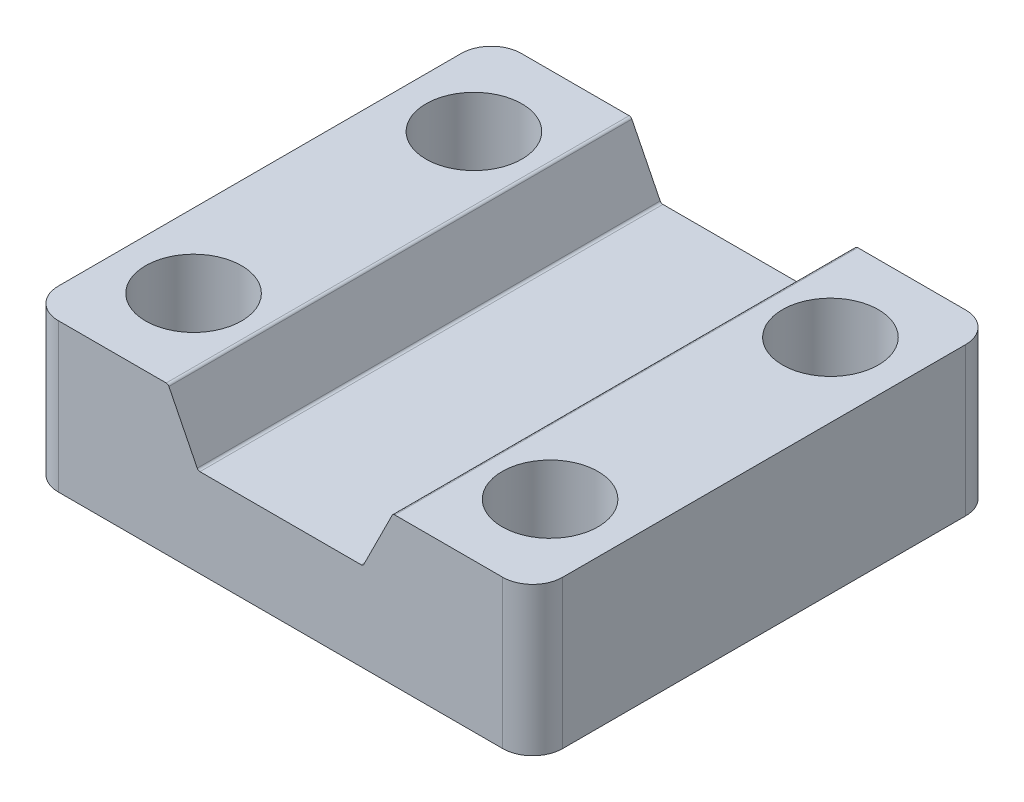
ISO-10303-21;
HEADER;
FILE_DESCRIPTION(('STEP AP214'),'2;1');
FILE_NAME('part.step','',(''),(''),'','','');
FILE_SCHEMA(('AUTOMOTIVE_DESIGN { 1 0 10303 214 1 1 1 1 }'));
ENDSEC;
DATA;
#1=APPLICATION_CONTEXT('core data for automotive mechanical design processes');
#2=APPLICATION_PROTOCOL_DEFINITION('international standard','automotive_design',2000,#1);
#3=PRODUCT_CONTEXT('',#1,'mechanical');
#4=PRODUCT('Part','Part','',(#3));
#5=PRODUCT_RELATED_PRODUCT_CATEGORY('part','',(#4));
#6=PRODUCT_DEFINITION_FORMATION('','',#4);
#7=PRODUCT_DEFINITION_CONTEXT('part definition',#1,'design');
#8=PRODUCT_DEFINITION('design','',#6,#7);
#9=PRODUCT_DEFINITION_SHAPE('','',#8);
#10=(LENGTH_UNIT() NAMED_UNIT(*) SI_UNIT(.MILLI.,.METRE.));
#11=(NAMED_UNIT(*) PLANE_ANGLE_UNIT() SI_UNIT($,.RADIAN.));
#12=(NAMED_UNIT(*) SI_UNIT($,.STERADIAN.) SOLID_ANGLE_UNIT());
#13=UNCERTAINTY_MEASURE_WITH_UNIT(LENGTH_MEASURE(1.E-05),#10,'distance_accuracy_value','');
#14=(GEOMETRIC_REPRESENTATION_CONTEXT(3) GLOBAL_UNCERTAINTY_ASSIGNED_CONTEXT((#13)) GLOBAL_UNIT_ASSIGNED_CONTEXT((#10,
#11,#12)) REPRESENTATION_CONTEXT('',''));
#15=CARTESIAN_POINT('',(0.,0.,0.));
#16=DIRECTION('',(0.,0.,1.));
#17=DIRECTION('',(1.,0.,0.));
#18=AXIS2_PLACEMENT_3D('',#15,#16,#17);
#19=CARTESIAN_POINT('',(0.,12.573,0.));
#20=DIRECTION('',(0.,1.,0.));
#21=DIRECTION('',(0.,0.,1.));
#22=AXIS2_PLACEMENT_3D('',#19,#20,#21);
#23=PLANE('',#22);
#24=CARTESIAN_POINT('',(-15.1003,12.573,-11.8745));
#25=DIRECTION('',(0.,1.,0.));
#26=DIRECTION('',(0.,0.,1.));
#27=AXIS2_PLACEMENT_3D('',#24,#25,#26);
#28=CIRCLE('',#27,4.06400000000003);
#29=CARTESIAN_POINT('',(-15.1003,12.573,-7.81049999999997));
#30=VERTEX_POINT('',#29);
#31=EDGE_CURVE('E298',#30,#30,#28,.T.);
#32=ORIENTED_EDGE('',*,*,#31,.F.);
#33=EDGE_LOOP('',(#32));
#34=FACE_BOUND('',#33,.T.);
#35=CARTESIAN_POINT('',(-15.1003,12.573,11.8745));
#36=DIRECTION('',(0.,1.,0.));
#37=DIRECTION('',(0.,0.,1.));
#38=AXIS2_PLACEMENT_3D('',#35,#36,#37);
#39=CIRCLE('',#38,4.06400000000003);
#40=CARTESIAN_POINT('',(-15.1003,12.573,15.9385));
#41=VERTEX_POINT('',#40);
#42=EDGE_CURVE('E286',#41,#41,#39,.T.);
#43=ORIENTED_EDGE('',*,*,#42,.F.);
#44=EDGE_LOOP('',(#43));
#45=FACE_BOUND('',#44,.T.);
#46=DIRECTION('',(-1.,0.,0.));
#47=VECTOR('',#46,1.);
#48=CARTESIAN_POINT('',(21.3614,12.573,-19.6088));
#49=LINE('',#48,#47);
#50=CARTESIAN_POINT('',(-9.6819806331425,12.573,-19.6088));
#51=VERTEX_POINT('',#50);
#52=CARTESIAN_POINT('',(-18.8214,12.573,-19.6088));
#53=VERTEX_POINT('',#52);
#54=EDGE_CURVE('E192',#51,#53,#49,.T.);
#55=ORIENTED_EDGE('',*,*,#54,.T.);
#56=CARTESIAN_POINT('',(-18.8214,12.573,-17.0688));
#57=DIRECTION('',(0.,1.,0.));
#58=DIRECTION('',(0.,0.,1.));
#59=AXIS2_PLACEMENT_3D('',#56,#57,#58);
#60=CIRCLE('',#59,2.54);
#61=CARTESIAN_POINT('',(-21.3614,12.573,-17.0688));
#62=VERTEX_POINT('',#61);
#63=EDGE_CURVE('E231',#53,#62,#60,.T.);
#64=ORIENTED_EDGE('',*,*,#63,.T.);
#65=DIRECTION('',(0.,0.,1.));
#66=VECTOR('',#65,1.);
#67=CARTESIAN_POINT('',(-21.3614,12.573,-19.6088));
#68=LINE('',#67,#66);
#69=CARTESIAN_POINT('',(-21.3614,12.573,17.0688));
#70=VERTEX_POINT('',#69);
#71=EDGE_CURVE('E268',#62,#70,#68,.T.);
#72=ORIENTED_EDGE('',*,*,#71,.T.);
#73=CARTESIAN_POINT('',(-18.8214,12.573,17.0688));
#74=DIRECTION('',(0.,1.,0.));
#75=DIRECTION('',(0.,0.,1.));
#76=AXIS2_PLACEMENT_3D('',#73,#74,#75);
#77=CIRCLE('',#76,2.54);
#78=CARTESIAN_POINT('',(-18.8214,12.573,19.6088));
#79=VERTEX_POINT('',#78);
#80=EDGE_CURVE('E229',#70,#79,#77,.T.);
#81=ORIENTED_EDGE('',*,*,#80,.T.);
#82=DIRECTION('',(1.,0.,0.));
#83=VECTOR('',#82,1.);
#84=CARTESIAN_POINT('',(-21.3614,12.573,19.6088));
#85=LINE('',#84,#83);
#86=CARTESIAN_POINT('',(-9.6819806331425,12.573,19.6088));
#87=VERTEX_POINT('',#86);
#88=EDGE_CURVE('E267',#79,#87,#85,.T.);
#89=ORIENTED_EDGE('',*,*,#88,.T.);
#90=DIRECTION('',(0.,0.,1.));
#91=VECTOR('',#90,1.);
#92=CARTESIAN_POINT('',(-9.6819806331425,12.573,-19.6088));
#93=LINE('',#92,#91);
#94=EDGE_CURVE('E162',#87,#51,#93,.F.);
#95=ORIENTED_EDGE('',*,*,#94,.T.);
#96=EDGE_LOOP('',(#55,#64,#72,#81,#89,#95));
#97=FACE_BOUND('',#96,.T.);
#98=ADVANCED_FACE('F37',(#34,#45,#97),#23,.T.);
#99=CARTESIAN_POINT('',(21.3614,0.,-19.6088));
#100=DIRECTION('',(0.,0.,-1.));
#101=DIRECTION('',(-1.,0.,0.));
#102=AXIS2_PLACEMENT_3D('',#99,#100,#101);
#103=PLANE('',#102);
#104=DIRECTION('',(-1.,0.,0.));
#105=VECTOR('',#104,1.);
#106=CARTESIAN_POINT('',(21.3614,0.,-19.6088));
#107=LINE('',#106,#105);
#108=CARTESIAN_POINT('',(18.8214,0.,-19.6088));
#109=VERTEX_POINT('',#108);
#110=CARTESIAN_POINT('',(-18.8214,0.,-19.6088));
#111=VERTEX_POINT('',#110);
#112=EDGE_CURVE('E280',#109,#111,#107,.T.);
#113=ORIENTED_EDGE('',*,*,#112,.T.);
#114=DIRECTION('',(0.,1.,0.));
#115=VECTOR('',#114,1.);
#116=CARTESIAN_POINT('',(-18.8214,0.,-19.6088));
#117=LINE('',#116,#115);
#118=EDGE_CURVE('E226',#111,#53,#117,.T.);
#119=ORIENTED_EDGE('',*,*,#118,.T.);
#120=ORIENTED_EDGE('',*,*,#54,.F.);
#121=CARTESIAN_POINT('',(-9.6819806331425,12.319,-19.6088));
#122=DIRECTION('',(0.,0.,-1.));
#123=DIRECTION('',(-1.,0.,0.));
#124=AXIS2_PLACEMENT_3D('',#121,#122,#123);
#125=CIRCLE('',#124,0.254000000000001);
#126=CARTESIAN_POINT('',(-9.45479612662852,12.432592253257,-19.6088));
#127=VERTEX_POINT('',#126);
#128=EDGE_CURVE('E178',#51,#127,#125,.T.);
#129=ORIENTED_EDGE('',*,*,#128,.T.);
#130=DIRECTION('',(0.447213595499961,-0.894427190999914,0.));
#131=VECTOR('',#130,1.);
#132=CARTESIAN_POINT('',(1.6814800000001,-9.83996000000004,-19.6088));
#133=LINE('',#132,#131);
#134=CARTESIAN_POINT('',(-7.05520387337151,7.63340774674301,-19.6088));
#135=VERTEX_POINT('',#134);
#136=EDGE_CURVE('E168',#135,#127,#133,.F.);
#137=ORIENTED_EDGE('',*,*,#136,.F.);
#138=CARTESIAN_POINT('',(-6.82801936685753,7.747,-19.6088));
#139=DIRECTION('',(0.,0.,-1.));
#140=DIRECTION('',(-1.,0.,0.));
#141=AXIS2_PLACEMENT_3D('',#138,#139,#140);
#142=CIRCLE('',#141,0.254000000000001);
#143=CARTESIAN_POINT('',(-6.82801936685753,7.493,-19.6088));
#144=VERTEX_POINT('',#143);
#145=EDGE_CURVE('E151',#135,#144,#142,.F.);
#146=ORIENTED_EDGE('',*,*,#145,.T.);
#147=DIRECTION('',(-1.,0.,0.));
#148=VECTOR('',#147,1.);
#149=CARTESIAN_POINT('',(6.985,7.493,-19.6088));
#150=LINE('',#149,#148);
#151=CARTESIAN_POINT('',(6.82801936685753,7.493,-19.6088));
#152=VERTEX_POINT('',#151);
#153=EDGE_CURVE('E180',#152,#144,#150,.T.);
#154=ORIENTED_EDGE('',*,*,#153,.F.);
#155=CARTESIAN_POINT('',(6.82801936685753,7.747,-19.6088));
#156=DIRECTION('',(0.,0.,-1.));
#157=DIRECTION('',(-1.,0.,0.));
#158=AXIS2_PLACEMENT_3D('',#155,#156,#157);
#159=CIRCLE('',#158,0.254000000000001);
#160=CARTESIAN_POINT('',(7.0552038733715,7.63340774674301,-19.6088));
#161=VERTEX_POINT('',#160);
#162=EDGE_CURVE('E220',#152,#161,#159,.F.);
#163=ORIENTED_EDGE('',*,*,#162,.T.);
#164=DIRECTION('',(0.447213595499961,0.894427190999914,0.));
#165=VECTOR('',#164,1.);
#166=CARTESIAN_POINT('',(6.86308000000002,7.24916000000005,-19.6088));
#167=LINE('',#166,#165);
#168=CARTESIAN_POINT('',(9.45479612662852,12.432592253257,-19.6088));
#169=VERTEX_POINT('',#168);
#170=EDGE_CURVE('E185',#169,#161,#167,.F.);
#171=ORIENTED_EDGE('',*,*,#170,.F.);
#172=CARTESIAN_POINT('',(9.6819806331425,12.319,-19.6088));
#173=DIRECTION('',(0.,0.,-1.));
#174=DIRECTION('',(-1.,0.,0.));
#175=AXIS2_PLACEMENT_3D('',#172,#173,#174);
#176=CIRCLE('',#175,0.254000000000001);
#177=CARTESIAN_POINT('',(9.6819806331425,12.573,-19.6088));
#178=VERTEX_POINT('',#177);
#179=EDGE_CURVE('E207',#169,#178,#176,.T.);
#180=ORIENTED_EDGE('',*,*,#179,.T.);
#181=CARTESIAN_POINT('',(18.8214,12.573,-19.6088));
#182=VERTEX_POINT('',#181);
#183=EDGE_CURVE('E270',#182,#178,#49,.T.);
#184=ORIENTED_EDGE('',*,*,#183,.F.);
#185=DIRECTION('',(0.,1.,0.));
#186=VECTOR('',#185,1.);
#187=CARTESIAN_POINT('',(18.8214,0.,-19.6088));
#188=LINE('',#187,#186);
#189=EDGE_CURVE('E224',#182,#109,#188,.F.);
#190=ORIENTED_EDGE('',*,*,#189,.T.);
#191=EDGE_LOOP('',(#113,#119,#120,#129,#137,#146,#154,#163,#171,#180,#184,#190));
#192=FACE_BOUND('',#191,.T.);
#193=ADVANCED_FACE('F176',(#192),#103,.T.);
#194=CARTESIAN_POINT('',(21.3614,0.,19.6088));
#195=DIRECTION('',(1.,0.,0.));
#196=DIRECTION('',(0.,0.,-1.));
#197=AXIS2_PLACEMENT_3D('',#194,#195,#196);
#198=PLANE('',#197);
#199=DIRECTION('',(0.,0.,-1.));
#200=VECTOR('',#199,1.);
#201=CARTESIAN_POINT('',(21.3614,0.,19.6088));
#202=LINE('',#201,#200);
#203=CARTESIAN_POINT('',(21.3614,0.,17.0688));
#204=VERTEX_POINT('',#203);
#205=CARTESIAN_POINT('',(21.3614,0.,-17.0688));
#206=VERTEX_POINT('',#205);
#207=EDGE_CURVE('E196',#204,#206,#202,.T.);
#208=ORIENTED_EDGE('',*,*,#207,.T.);
#209=DIRECTION('',(0.,1.,0.));
#210=VECTOR('',#209,1.);
#211=CARTESIAN_POINT('',(21.3614,0.,-17.0688));
#212=LINE('',#211,#210);
#213=CARTESIAN_POINT('',(21.3614,12.573,-17.0688));
#214=VERTEX_POINT('',#213);
#215=EDGE_CURVE('E248',#206,#214,#212,.T.);
#216=ORIENTED_EDGE('',*,*,#215,.T.);
#217=DIRECTION('',(0.,0.,-1.));
#218=VECTOR('',#217,1.);
#219=CARTESIAN_POINT('',(21.3614,12.573,19.6088));
#220=LINE('',#219,#218);
#221=CARTESIAN_POINT('',(21.3614,12.573,17.0688));
#222=VERTEX_POINT('',#221);
#223=EDGE_CURVE('E189',#222,#214,#220,.T.);
#224=ORIENTED_EDGE('',*,*,#223,.F.);
#225=DIRECTION('',(0.,1.,0.));
#226=VECTOR('',#225,1.);
#227=CARTESIAN_POINT('',(21.3614,0.,17.0688));
#228=LINE('',#227,#226);
#229=EDGE_CURVE('E246',#222,#204,#228,.F.);
#230=ORIENTED_EDGE('',*,*,#229,.T.);
#231=EDGE_LOOP('',(#208,#216,#224,#230));
#232=FACE_BOUND('',#231,.T.);
#233=ADVANCED_FACE('F337',(#232),#198,.T.);
#234=CARTESIAN_POINT('',(-21.3614,0.,19.6088));
#235=DIRECTION('',(0.,0.,1.));
#236=DIRECTION('',(1.,0.,0.));
#237=AXIS2_PLACEMENT_3D('',#234,#235,#236);
#238=PLANE('',#237);
#239=ORIENTED_EDGE('',*,*,#88,.F.);
#240=DIRECTION('',(0.,1.,0.));
#241=VECTOR('',#240,1.);
#242=CARTESIAN_POINT('',(-18.8214,0.,19.6088));
#243=LINE('',#242,#241);
#244=CARTESIAN_POINT('',(-18.8214,0.,19.6088));
#245=VERTEX_POINT('',#244);
#246=EDGE_CURVE('E11',#79,#245,#243,.F.);
#247=ORIENTED_EDGE('',*,*,#246,.T.);
#248=DIRECTION('',(1.,0.,0.));
#249=VECTOR('',#248,1.);
#250=CARTESIAN_POINT('',(-21.3614,0.,19.6088));
#251=LINE('',#250,#249);
#252=CARTESIAN_POINT('',(18.8214,0.,19.6088));
#253=VERTEX_POINT('',#252);
#254=EDGE_CURVE('E260',#245,#253,#251,.T.);
#255=ORIENTED_EDGE('',*,*,#254,.T.);
#256=DIRECTION('',(0.,1.,0.));
#257=VECTOR('',#256,1.);
#258=CARTESIAN_POINT('',(18.8214,0.,19.6088));
#259=LINE('',#258,#257);
#260=CARTESIAN_POINT('',(18.8214,12.573,19.6088));
#261=VERTEX_POINT('',#260);
#262=EDGE_CURVE('E45',#253,#261,#259,.T.);
#263=ORIENTED_EDGE('',*,*,#262,.T.);
#264=CARTESIAN_POINT('',(9.6819806331425,12.573,19.6088));
#265=VERTEX_POINT('',#264);
#266=EDGE_CURVE('E257',#265,#261,#85,.T.);
#267=ORIENTED_EDGE('',*,*,#266,.F.);
#268=CARTESIAN_POINT('',(9.6819806331425,12.319,19.6088));
#269=DIRECTION('',(0.,0.,1.));
#270=DIRECTION('',(1.,0.,0.));
#271=AXIS2_PLACEMENT_3D('',#268,#269,#270);
#272=CIRCLE('',#271,0.254000000000001);
#273=CARTESIAN_POINT('',(9.45479612662852,12.432592253257,19.6088));
#274=VERTEX_POINT('',#273);
#275=EDGE_CURVE('E215',#265,#274,#272,.T.);
#276=ORIENTED_EDGE('',*,*,#275,.T.);
#277=DIRECTION('',(0.447213595499961,0.894427190999914,0.));
#278=VECTOR('',#277,1.);
#279=CARTESIAN_POINT('',(6.985,7.493,19.6088));
#280=LINE('',#279,#278);
#281=CARTESIAN_POINT('',(7.05520387337151,7.63340774674301,19.6088));
#282=VERTEX_POINT('',#281);
#283=EDGE_CURVE('E179',#274,#282,#280,.F.);
#284=ORIENTED_EDGE('',*,*,#283,.T.);
#285=CARTESIAN_POINT('',(6.82801936685753,7.747,19.6088));
#286=DIRECTION('',(0.,0.,1.));
#287=DIRECTION('',(1.,0.,0.));
#288=AXIS2_PLACEMENT_3D('',#285,#286,#287);
#289=CIRCLE('',#288,0.254000000000001);
#290=CARTESIAN_POINT('',(6.82801936685753,7.493,19.6088));
#291=VERTEX_POINT('',#290);
#292=EDGE_CURVE('E222',#282,#291,#289,.F.);
#293=ORIENTED_EDGE('',*,*,#292,.T.);
#294=DIRECTION('',(-1.,0.,0.));
#295=VECTOR('',#294,1.);
#296=CARTESIAN_POINT('',(6.985,7.493,19.6088));
#297=LINE('',#296,#295);
#298=CARTESIAN_POINT('',(-6.82801936685753,7.493,19.6088));
#299=VERTEX_POINT('',#298);
#300=EDGE_CURVE('E183',#291,#299,#297,.T.);
#301=ORIENTED_EDGE('',*,*,#300,.T.);
#302=CARTESIAN_POINT('',(-6.82801936685753,7.747,19.6088));
#303=DIRECTION('',(0.,0.,1.));
#304=DIRECTION('',(1.,0.,0.));
#305=AXIS2_PLACEMENT_3D('',#302,#303,#304);
#306=CIRCLE('',#305,0.254000000000001);
#307=CARTESIAN_POINT('',(-7.05520387337151,7.63340774674301,19.6088));
#308=VERTEX_POINT('',#307);
#309=EDGE_CURVE('E161',#299,#308,#306,.F.);
#310=ORIENTED_EDGE('',*,*,#309,.T.);
#311=DIRECTION('',(0.447213595499961,-0.894427190999914,0.));
#312=VECTOR('',#311,1.);
#313=CARTESIAN_POINT('',(-6.985,7.493,19.6088));
#314=LINE('',#313,#312);
#315=CARTESIAN_POINT('',(-9.45479612662852,12.432592253257,19.6088));
#316=VERTEX_POINT('',#315);
#317=EDGE_CURVE('E171',#308,#316,#314,.F.);
#318=ORIENTED_EDGE('',*,*,#317,.T.);
#319=CARTESIAN_POINT('',(-9.6819806331425,12.319,19.6088));
#320=DIRECTION('',(0.,0.,1.));
#321=DIRECTION('',(1.,0.,0.));
#322=AXIS2_PLACEMENT_3D('',#319,#320,#321);
#323=CIRCLE('',#322,0.254000000000001);
#324=EDGE_CURVE('E212',#316,#87,#323,.T.);
#325=ORIENTED_EDGE('',*,*,#324,.T.);
#326=EDGE_LOOP('',(#239,#247,#255,#263,#267,#276,#284,#293,#301,#310,#318,#325));
#327=FACE_BOUND('',#326,.T.);
#328=ADVANCED_FACE('F256',(#327),#238,.T.);
#329=CARTESIAN_POINT('',(-21.3614,0.,-19.6088));
#330=DIRECTION('',(-1.,0.,0.));
#331=DIRECTION('',(0.,0.,1.));
#332=AXIS2_PLACEMENT_3D('',#329,#330,#331);
#333=PLANE('',#332);
#334=ORIENTED_EDGE('',*,*,#71,.F.);
#335=DIRECTION('',(0.,1.,0.));
#336=VECTOR('',#335,1.);
#337=CARTESIAN_POINT('',(-21.3614,0.,-17.0688));
#338=LINE('',#337,#336);
#339=CARTESIAN_POINT('',(-21.3614,0.,-17.0688));
#340=VERTEX_POINT('',#339);
#341=EDGE_CURVE('E236',#62,#340,#338,.F.);
#342=ORIENTED_EDGE('',*,*,#341,.T.);
#343=DIRECTION('',(0.,0.,1.));
#344=VECTOR('',#343,1.);
#345=CARTESIAN_POINT('',(-21.3614,0.,-19.6088));
#346=LINE('',#345,#344);
#347=CARTESIAN_POINT('',(-21.3614,0.,17.0688));
#348=VERTEX_POINT('',#347);
#349=EDGE_CURVE('E277',#340,#348,#346,.T.);
#350=ORIENTED_EDGE('',*,*,#349,.T.);
#351=DIRECTION('',(0.,1.,0.));
#352=VECTOR('',#351,1.);
#353=CARTESIAN_POINT('',(-21.3614,0.,17.0688));
#354=LINE('',#353,#352);
#355=EDGE_CURVE('E233',#348,#70,#354,.T.);
#356=ORIENTED_EDGE('',*,*,#355,.T.);
#357=EDGE_LOOP('',(#334,#342,#350,#356));
#358=FACE_BOUND('',#357,.T.);
#359=ADVANCED_FACE('F349',(#358),#333,.T.);
#360=CARTESIAN_POINT('',(0.,0.,0.));
#361=DIRECTION('',(0.,1.,0.));
#362=DIRECTION('',(0.,0.,1.));
#363=AXIS2_PLACEMENT_3D('',#360,#361,#362);
#364=PLANE('',#363);
#365=CARTESIAN_POINT('',(15.1003,0.,11.8745));
#366=DIRECTION('',(0.,1.,0.));
#367=DIRECTION('',(0.,0.,1.));
#368=AXIS2_PLACEMENT_3D('',#365,#366,#367);
#369=CIRCLE('',#368,4.06400000000003);
#370=CARTESIAN_POINT('',(15.1003,0.,15.9385));
#371=VERTEX_POINT('',#370);
#372=EDGE_CURVE('E301',#371,#371,#369,.T.);
#373=ORIENTED_EDGE('',*,*,#372,.T.);
#374=EDGE_LOOP('',(#373));
#375=FACE_BOUND('',#374,.T.);
#376=CARTESIAN_POINT('',(-15.1003,0.,-11.8745));
#377=DIRECTION('',(0.,1.,0.));
#378=DIRECTION('',(0.,0.,1.));
#379=AXIS2_PLACEMENT_3D('',#376,#377,#378);
#380=CIRCLE('',#379,4.06400000000003);
#381=CARTESIAN_POINT('',(-15.1003,0.,-7.81049999999997));
#382=VERTEX_POINT('',#381);
#383=EDGE_CURVE('E295',#382,#382,#380,.T.);
#384=ORIENTED_EDGE('',*,*,#383,.T.);
#385=EDGE_LOOP('',(#384));
#386=FACE_BOUND('',#385,.T.);
#387=CARTESIAN_POINT('',(15.1003,0.,-11.8745));
#388=DIRECTION('',(0.,1.,0.));
#389=DIRECTION('',(0.,0.,1.));
#390=AXIS2_PLACEMENT_3D('',#387,#388,#389);
#391=CIRCLE('',#390,4.06400000000003);
#392=CARTESIAN_POINT('',(15.1003,0.,-7.81049999999997));
#393=VERTEX_POINT('',#392);
#394=EDGE_CURVE('E289',#393,#393,#391,.T.);
#395=ORIENTED_EDGE('',*,*,#394,.T.);
#396=EDGE_LOOP('',(#395));
#397=FACE_BOUND('',#396,.T.);
#398=CARTESIAN_POINT('',(-15.1003,0.,11.8745));
#399=DIRECTION('',(0.,1.,0.));
#400=DIRECTION('',(0.,0.,1.));
#401=AXIS2_PLACEMENT_3D('',#398,#399,#400);
#402=CIRCLE('',#401,4.06400000000003);
#403=CARTESIAN_POINT('',(-15.1003,0.,15.9385));
#404=VERTEX_POINT('',#403);
#405=EDGE_CURVE('E194',#404,#404,#402,.T.);
#406=ORIENTED_EDGE('',*,*,#405,.T.);
#407=EDGE_LOOP('',(#406));
#408=FACE_BOUND('',#407,.T.);
#409=ORIENTED_EDGE('',*,*,#349,.F.);
#410=CARTESIAN_POINT('',(-18.8214,0.,-17.0688));
#411=DIRECTION('',(0.,1.,0.));
#412=DIRECTION('',(0.,0.,1.));
#413=AXIS2_PLACEMENT_3D('',#410,#411,#412);
#414=CIRCLE('',#413,2.54);
#415=EDGE_CURVE('E244',#340,#111,#414,.F.);
#416=ORIENTED_EDGE('',*,*,#415,.T.);
#417=ORIENTED_EDGE('',*,*,#112,.F.);
#418=CARTESIAN_POINT('',(18.8214,0.,-17.0688));
#419=DIRECTION('',(0.,1.,0.));
#420=DIRECTION('',(0.,0.,1.));
#421=AXIS2_PLACEMENT_3D('',#418,#419,#420);
#422=CIRCLE('',#421,2.54);
#423=EDGE_CURVE('E242',#109,#206,#422,.F.);
#424=ORIENTED_EDGE('',*,*,#423,.T.);
#425=ORIENTED_EDGE('',*,*,#207,.F.);
#426=CARTESIAN_POINT('',(18.8214,0.,17.0688));
#427=DIRECTION('',(0.,1.,0.));
#428=DIRECTION('',(0.,0.,1.));
#429=AXIS2_PLACEMENT_3D('',#426,#427,#428);
#430=CIRCLE('',#429,2.54);
#431=EDGE_CURVE('E238',#204,#253,#430,.F.);
#432=ORIENTED_EDGE('',*,*,#431,.T.);
#433=ORIENTED_EDGE('',*,*,#254,.F.);
#434=CARTESIAN_POINT('',(-18.8214,0.,17.0688));
#435=DIRECTION('',(0.,1.,0.));
#436=DIRECTION('',(0.,0.,1.));
#437=AXIS2_PLACEMENT_3D('',#434,#435,#436);
#438=CIRCLE('',#437,2.54);
#439=EDGE_CURVE('E240',#245,#348,#438,.F.);
#440=ORIENTED_EDGE('',*,*,#439,.T.);
#441=EDGE_LOOP('',(#409,#416,#417,#424,#425,#432,#433,#440));
#442=FACE_BOUND('',#441,.T.);
#443=ADVANCED_FACE('F312',(#375,#386,#397,#408,#442),#364,.F.);
#444=CARTESIAN_POINT('',(15.1003,12.573,11.8745));
#445=DIRECTION('',(0.,1.,0.));
#446=DIRECTION('',(0.,0.,1.));
#447=AXIS2_PLACEMENT_3D('',#444,#445,#446);
#448=CIRCLE('',#447,4.06400000000003);
#449=CARTESIAN_POINT('',(15.1003,12.573,15.9385));
#450=VERTEX_POINT('',#449);
#451=EDGE_CURVE('E304',#450,#450,#448,.T.);
#452=ORIENTED_EDGE('',*,*,#451,.F.);
#453=EDGE_LOOP('',(#452));
#454=FACE_BOUND('',#453,.T.);
#455=CARTESIAN_POINT('',(15.1003,12.573,-11.8745));
#456=DIRECTION('',(0.,1.,0.));
#457=DIRECTION('',(0.,0.,1.));
#458=AXIS2_PLACEMENT_3D('',#455,#456,#457);
#459=CIRCLE('',#458,4.06400000000003);
#460=CARTESIAN_POINT('',(15.1003,12.573,-7.81049999999997));
#461=VERTEX_POINT('',#460);
#462=EDGE_CURVE('E292',#461,#461,#459,.T.);
#463=ORIENTED_EDGE('',*,*,#462,.F.);
#464=EDGE_LOOP('',(#463));
#465=FACE_BOUND('',#464,.T.);
#466=ORIENTED_EDGE('',*,*,#223,.T.);
#467=CARTESIAN_POINT('',(18.8214,12.573,-17.0688));
#468=DIRECTION('',(0.,1.,0.));
#469=DIRECTION('',(0.,0.,1.));
#470=AXIS2_PLACEMENT_3D('',#467,#468,#469);
#471=CIRCLE('',#470,2.54);
#472=EDGE_CURVE('E60',#214,#182,#471,.T.);
#473=ORIENTED_EDGE('',*,*,#472,.T.);
#474=ORIENTED_EDGE('',*,*,#183,.T.);
#475=DIRECTION('',(0.,0.,1.));
#476=VECTOR('',#475,1.);
#477=CARTESIAN_POINT('',(9.6819806331425,12.573,19.6088));
#478=LINE('',#477,#476);
#479=EDGE_CURVE('E210',#178,#265,#478,.T.);
#480=ORIENTED_EDGE('',*,*,#479,.T.);
#481=ORIENTED_EDGE('',*,*,#266,.T.);
#482=CARTESIAN_POINT('',(18.8214,12.573,17.0688));
#483=DIRECTION('',(0.,1.,0.));
#484=DIRECTION('',(0.,0.,1.));
#485=AXIS2_PLACEMENT_3D('',#482,#483,#484);
#486=CIRCLE('',#485,2.54);
#487=EDGE_CURVE('E52',#261,#222,#486,.T.);
#488=ORIENTED_EDGE('',*,*,#487,.T.);
#489=EDGE_LOOP('',(#466,#473,#474,#480,#481,#488));
#490=FACE_BOUND('',#489,.T.);
#491=ADVANCED_FACE('F264',(#454,#465,#490),#23,.T.);
#492=CARTESIAN_POINT('',(-6.985,7.493,19.6088));
#493=DIRECTION('',(0.894427190999914,0.447213595499961,0.));
#494=DIRECTION('',(-0.447213595499961,0.894427190999914,0.));
#495=AXIS2_PLACEMENT_3D('',#492,#493,#494);
#496=PLANE('',#495);
#497=ORIENTED_EDGE('',*,*,#317,.F.);
#498=DIRECTION('',(0.,0.,-1.));
#499=VECTOR('',#498,1.);
#500=CARTESIAN_POINT('',(-7.05520387337151,7.63340774674301,-19.6088));
#501=LINE('',#500,#499);
#502=EDGE_CURVE('E155',#308,#135,#501,.T.);
#503=ORIENTED_EDGE('',*,*,#502,.T.);
#504=ORIENTED_EDGE('',*,*,#136,.T.);
#505=DIRECTION('',(0.,0.,-1.));
#506=VECTOR('',#505,1.);
#507=CARTESIAN_POINT('',(-9.45479612662852,12.432592253257,19.6088));
#508=LINE('',#507,#506);
#509=EDGE_CURVE('E173',#127,#316,#508,.F.);
#510=ORIENTED_EDGE('',*,*,#509,.T.);
#511=EDGE_LOOP('',(#497,#503,#504,#510));
#512=FACE_BOUND('',#511,.T.);
#513=ADVANCED_FACE('F167',(#512),#496,.T.);
#514=CARTESIAN_POINT('',(6.985,7.493,19.6088));
#515=DIRECTION('',(0.,-1.,0.));
#516=DIRECTION('',(0.,0.,-1.));
#517=AXIS2_PLACEMENT_3D('',#514,#515,#516);
#518=PLANE('',#517);
#519=ORIENTED_EDGE('',*,*,#153,.T.);
#520=DIRECTION('',(0.,0.,1.));
#521=VECTOR('',#520,1.);
#522=CARTESIAN_POINT('',(-6.82801936685753,7.493,19.6088));
#523=LINE('',#522,#521);
#524=EDGE_CURVE('E156',#144,#299,#523,.T.);
#525=ORIENTED_EDGE('',*,*,#524,.T.);
#526=ORIENTED_EDGE('',*,*,#300,.F.);
#527=DIRECTION('',(0.,0.,1.));
#528=VECTOR('',#527,1.);
#529=CARTESIAN_POINT('',(6.82801936685753,7.493,-19.6088));
#530=LINE('',#529,#528);
#531=EDGE_CURVE('E172',#291,#152,#530,.F.);
#532=ORIENTED_EDGE('',*,*,#531,.T.);
#533=EDGE_LOOP('',(#519,#525,#526,#532));
#534=FACE_BOUND('',#533,.T.);
#535=ADVANCED_FACE('F355',(#534),#518,.F.);
#536=CARTESIAN_POINT('',(6.985,7.493,19.6088));
#537=DIRECTION('',(-0.894427190999914,0.447213595499961,0.));
#538=DIRECTION('',(-0.447213595499961,-0.894427190999914,0.));
#539=AXIS2_PLACEMENT_3D('',#536,#537,#538);
#540=PLANE('',#539);
#541=ORIENTED_EDGE('',*,*,#283,.F.);
#542=DIRECTION('',(0.,0.,-1.));
#543=VECTOR('',#542,1.);
#544=CARTESIAN_POINT('',(9.45479612662852,12.432592253257,-19.6088));
#545=LINE('',#544,#543);
#546=EDGE_CURVE('E203',#274,#169,#545,.T.);
#547=ORIENTED_EDGE('',*,*,#546,.T.);
#548=ORIENTED_EDGE('',*,*,#170,.T.);
#549=DIRECTION('',(0.,0.,-1.));
#550=VECTOR('',#549,1.);
#551=CARTESIAN_POINT('',(7.05520387337151,7.63340774674301,19.6088));
#552=LINE('',#551,#550);
#553=EDGE_CURVE('E201',#161,#282,#552,.F.);
#554=ORIENTED_EDGE('',*,*,#553,.T.);
#555=EDGE_LOOP('',(#541,#547,#548,#554));
#556=FACE_BOUND('',#555,.T.);
#557=ADVANCED_FACE('F328',(#556),#540,.T.);
#558=CARTESIAN_POINT('',(-15.1003,12.573,11.8745));
#559=DIRECTION('',(0.,1.,0.));
#560=DIRECTION('',(0.,0.,1.));
#561=AXIS2_PLACEMENT_3D('',#558,#559,#560);
#562=CYLINDRICAL_SURFACE('',#561,4.06400000000003);
#563=ORIENTED_EDGE('',*,*,#405,.F.);
#564=EDGE_LOOP('',(#563));
#565=FACE_BOUND('',#564,.T.);
#566=ORIENTED_EDGE('',*,*,#42,.T.);
#567=EDGE_LOOP('',(#566));
#568=FACE_BOUND('',#567,.T.);
#569=ADVANCED_FACE('F319',(#565,#568),#562,.F.);
#570=CARTESIAN_POINT('',(15.1003,12.573,-11.8745));
#571=DIRECTION('',(0.,1.,0.));
#572=DIRECTION('',(0.,0.,1.));
#573=AXIS2_PLACEMENT_3D('',#570,#571,#572);
#574=CYLINDRICAL_SURFACE('',#573,4.06400000000003);
#575=ORIENTED_EDGE('',*,*,#394,.F.);
#576=EDGE_LOOP('',(#575));
#577=FACE_BOUND('',#576,.T.);
#578=ORIENTED_EDGE('',*,*,#462,.T.);
#579=EDGE_LOOP('',(#578));
#580=FACE_BOUND('',#579,.T.);
#581=ADVANCED_FACE('F316',(#577,#580),#574,.F.);
#582=CARTESIAN_POINT('',(-15.1003,12.573,-11.8745));
#583=DIRECTION('',(0.,1.,0.));
#584=DIRECTION('',(0.,0.,1.));
#585=AXIS2_PLACEMENT_3D('',#582,#583,#584);
#586=CYLINDRICAL_SURFACE('',#585,4.06400000000003);
#587=ORIENTED_EDGE('',*,*,#383,.F.);
#588=EDGE_LOOP('',(#587));
#589=FACE_BOUND('',#588,.T.);
#590=ORIENTED_EDGE('',*,*,#31,.T.);
#591=EDGE_LOOP('',(#590));
#592=FACE_BOUND('',#591,.T.);
#593=ADVANCED_FACE('F318',(#589,#592),#586,.F.);
#594=CARTESIAN_POINT('',(15.1003,12.573,11.8745));
#595=DIRECTION('',(0.,1.,0.));
#596=DIRECTION('',(0.,0.,1.));
#597=AXIS2_PLACEMENT_3D('',#594,#595,#596);
#598=CYLINDRICAL_SURFACE('',#597,4.06400000000003);
#599=ORIENTED_EDGE('',*,*,#372,.F.);
#600=EDGE_LOOP('',(#599));
#601=FACE_BOUND('',#600,.T.);
#602=ORIENTED_EDGE('',*,*,#451,.T.);
#603=EDGE_LOOP('',(#602));
#604=FACE_BOUND('',#603,.T.);
#605=ADVANCED_FACE('F308',(#601,#604),#598,.F.);
#606=CARTESIAN_POINT('',(-6.82801936685753,7.747,19.6088));
#607=DIRECTION('',(0.,0.,-1.));
#608=DIRECTION('',(-1.,0.,0.));
#609=AXIS2_PLACEMENT_3D('',#606,#607,#608);
#610=CYLINDRICAL_SURFACE('',#609,0.254000000000001);
#611=ORIENTED_EDGE('',*,*,#309,.F.);
#612=ORIENTED_EDGE('',*,*,#524,.F.);
#613=ORIENTED_EDGE('',*,*,#145,.F.);
#614=ORIENTED_EDGE('',*,*,#502,.F.);
#615=EDGE_LOOP('',(#611,#612,#613,#614));
#616=FACE_BOUND('',#615,.T.);
#617=ADVANCED_FACE('F154',(#616),#610,.F.);
#618=CARTESIAN_POINT('',(9.6819806331425,12.319,19.6088));
#619=DIRECTION('',(0.,0.,-1.));
#620=DIRECTION('',(-1.,0.,0.));
#621=AXIS2_PLACEMENT_3D('',#618,#619,#620);
#622=CYLINDRICAL_SURFACE('',#621,0.254000000000001);
#623=ORIENTED_EDGE('',*,*,#275,.F.);
#624=ORIENTED_EDGE('',*,*,#479,.F.);
#625=ORIENTED_EDGE('',*,*,#179,.F.);
#626=ORIENTED_EDGE('',*,*,#546,.F.);
#627=EDGE_LOOP('',(#623,#624,#625,#626));
#628=FACE_BOUND('',#627,.T.);
#629=ADVANCED_FACE('F361',(#628),#622,.T.);
#630=CARTESIAN_POINT('',(6.82801936685753,7.747,19.6088));
#631=DIRECTION('',(0.,0.,-1.));
#632=DIRECTION('',(-1.,0.,0.));
#633=AXIS2_PLACEMENT_3D('',#630,#631,#632);
#634=CYLINDRICAL_SURFACE('',#633,0.254000000000001);
#635=ORIENTED_EDGE('',*,*,#292,.F.);
#636=ORIENTED_EDGE('',*,*,#553,.F.);
#637=ORIENTED_EDGE('',*,*,#162,.F.);
#638=ORIENTED_EDGE('',*,*,#531,.F.);
#639=EDGE_LOOP('',(#635,#636,#637,#638));
#640=FACE_BOUND('',#639,.T.);
#641=ADVANCED_FACE('F364',(#640),#634,.F.);
#642=CARTESIAN_POINT('',(-9.6819806331425,12.319,0.));
#643=DIRECTION('',(0.,0.,-1.));
#644=DIRECTION('',(-1.,0.,0.));
#645=AXIS2_PLACEMENT_3D('',#642,#643,#644);
#646=CYLINDRICAL_SURFACE('',#645,0.254000000000001);
#647=ORIENTED_EDGE('',*,*,#324,.F.);
#648=ORIENTED_EDGE('',*,*,#509,.F.);
#649=ORIENTED_EDGE('',*,*,#128,.F.);
#650=ORIENTED_EDGE('',*,*,#94,.F.);
#651=EDGE_LOOP('',(#647,#648,#649,#650));
#652=FACE_BOUND('',#651,.T.);
#653=ADVANCED_FACE('F368',(#652),#646,.T.);
#654=CARTESIAN_POINT('',(-18.8214,0.,-17.0688));
#655=DIRECTION('',(0.,1.,0.));
#656=DIRECTION('',(0.,0.,1.));
#657=AXIS2_PLACEMENT_3D('',#654,#655,#656);
#658=CYLINDRICAL_SURFACE('',#657,2.54);
#659=ORIENTED_EDGE('',*,*,#415,.F.);
#660=ORIENTED_EDGE('',*,*,#341,.F.);
#661=ORIENTED_EDGE('',*,*,#63,.F.);
#662=ORIENTED_EDGE('',*,*,#118,.F.);
#663=EDGE_LOOP('',(#659,#660,#661,#662));
#664=FACE_BOUND('',#663,.T.);
#665=ADVANCED_FACE('F372',(#664),#658,.T.);
#666=CARTESIAN_POINT('',(18.8214,0.,-17.0688));
#667=DIRECTION('',(0.,1.,0.));
#668=DIRECTION('',(0.,0.,1.));
#669=AXIS2_PLACEMENT_3D('',#666,#667,#668);
#670=CYLINDRICAL_SURFACE('',#669,2.54);
#671=ORIENTED_EDGE('',*,*,#423,.F.);
#672=ORIENTED_EDGE('',*,*,#189,.F.);
#673=ORIENTED_EDGE('',*,*,#472,.F.);
#674=ORIENTED_EDGE('',*,*,#215,.F.);
#675=EDGE_LOOP('',(#671,#672,#673,#674));
#676=FACE_BOUND('',#675,.T.);
#677=ADVANCED_FACE('F376',(#676),#670,.T.);
#678=CARTESIAN_POINT('',(-18.8214,0.,17.0688));
#679=DIRECTION('',(0.,1.,0.));
#680=DIRECTION('',(0.,0.,1.));
#681=AXIS2_PLACEMENT_3D('',#678,#679,#680);
#682=CYLINDRICAL_SURFACE('',#681,2.54);
#683=ORIENTED_EDGE('',*,*,#439,.F.);
#684=ORIENTED_EDGE('',*,*,#246,.F.);
#685=ORIENTED_EDGE('',*,*,#80,.F.);
#686=ORIENTED_EDGE('',*,*,#355,.F.);
#687=EDGE_LOOP('',(#683,#684,#685,#686));
#688=FACE_BOUND('',#687,.T.);
#689=ADVANCED_FACE('F379',(#688),#682,.T.);
#690=CARTESIAN_POINT('',(18.8214,0.,17.0688));
#691=DIRECTION('',(0.,1.,0.));
#692=DIRECTION('',(0.,0.,1.));
#693=AXIS2_PLACEMENT_3D('',#690,#691,#692);
#694=CYLINDRICAL_SURFACE('',#693,2.54);
#695=ORIENTED_EDGE('',*,*,#431,.F.);
#696=ORIENTED_EDGE('',*,*,#229,.F.);
#697=ORIENTED_EDGE('',*,*,#487,.F.);
#698=ORIENTED_EDGE('',*,*,#262,.F.);
#699=EDGE_LOOP('',(#695,#696,#697,#698));
#700=FACE_BOUND('',#699,.T.);
#701=ADVANCED_FACE('F39',(#700),#694,.T.);
#702=CLOSED_SHELL('',(#98,#193,#233,#328,#359,#443,#491,#513,#535,#557,#569,#581,#593,#605,#617,
#629,#641,#653,#665,#677,#689,#701));
#703=MANIFOLD_SOLID_BREP('B2',#702);
#704=ADVANCED_BREP_SHAPE_REPRESENTATION('',(#18,#703),#14);
#705=SHAPE_DEFINITION_REPRESENTATION(#9,#704);
ENDSEC;
END-ISO-10303-21;
